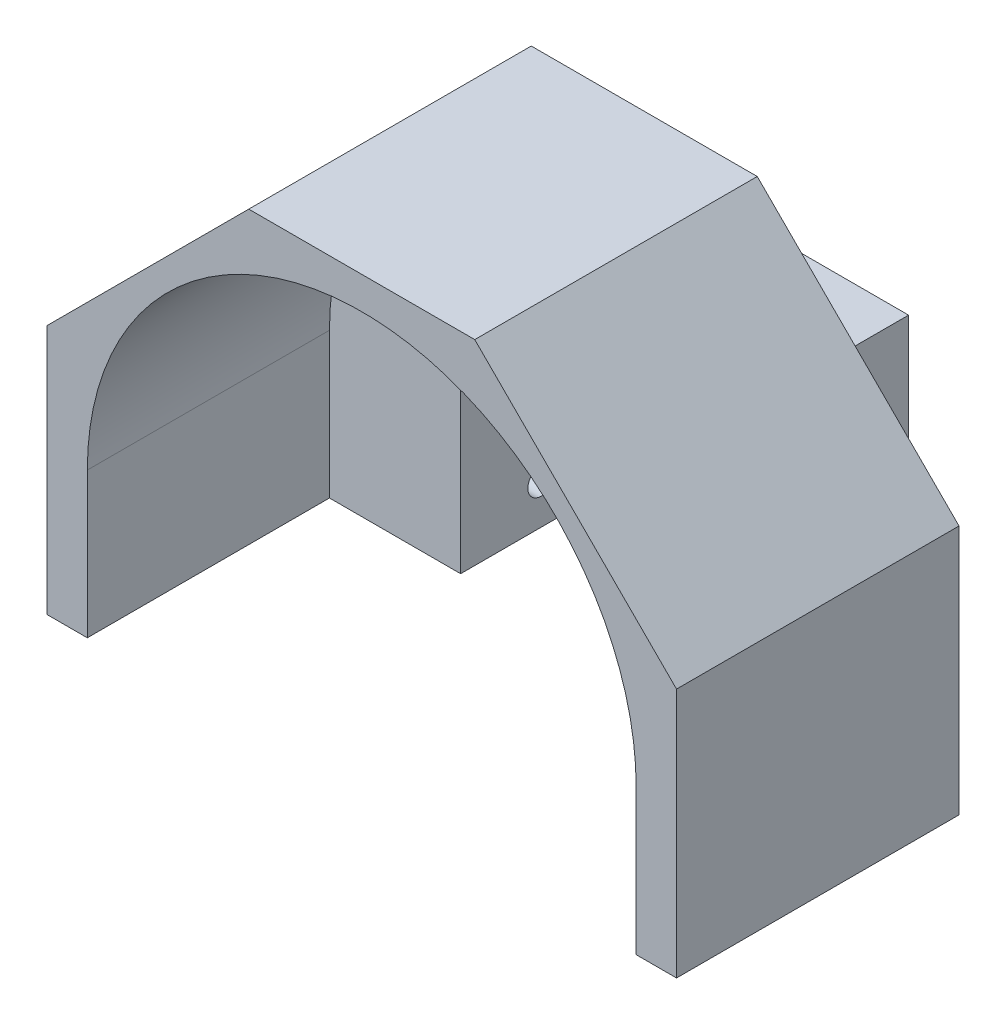
ISO-10303-21;
HEADER;
FILE_DESCRIPTION(('STEP AP214'),'2;1');
FILE_NAME('part.step','',(''),(''),'','','');
FILE_SCHEMA(('AUTOMOTIVE_DESIGN { 1 0 10303 214 1 1 1 1 }'));
ENDSEC;
DATA;
#1=APPLICATION_CONTEXT('core data for automotive mechanical design processes');
#2=APPLICATION_PROTOCOL_DEFINITION('international standard','automotive_design',2000,#1);
#3=PRODUCT_CONTEXT('',#1,'mechanical');
#4=PRODUCT('Part','Part','',(#3));
#5=PRODUCT_RELATED_PRODUCT_CATEGORY('part','',(#4));
#6=PRODUCT_DEFINITION_FORMATION('','',#4);
#7=PRODUCT_DEFINITION_CONTEXT('part definition',#1,'design');
#8=PRODUCT_DEFINITION('design','',#6,#7);
#9=PRODUCT_DEFINITION_SHAPE('','',#8);
#10=(LENGTH_UNIT() NAMED_UNIT(*) SI_UNIT(.MILLI.,.METRE.));
#11=(NAMED_UNIT(*) PLANE_ANGLE_UNIT() SI_UNIT($,.RADIAN.));
#12=(NAMED_UNIT(*) SI_UNIT($,.STERADIAN.) SOLID_ANGLE_UNIT());
#13=UNCERTAINTY_MEASURE_WITH_UNIT(LENGTH_MEASURE(1.E-05),#10,'distance_accuracy_value','');
#14=(GEOMETRIC_REPRESENTATION_CONTEXT(3) GLOBAL_UNCERTAINTY_ASSIGNED_CONTEXT((#13)) GLOBAL_UNIT_ASSIGNED_CONTEXT((#10,
#11,#12)) REPRESENTATION_CONTEXT('',''));
#15=CARTESIAN_POINT('',(0.,0.,0.));
#16=DIRECTION('',(0.,0.,1.));
#17=DIRECTION('',(1.,0.,0.));
#18=AXIS2_PLACEMENT_3D('',#15,#16,#17);
#19=CARTESIAN_POINT('',(39.,28.,45.));
#20=DIRECTION('',(-1.,0.,0.));
#21=DIRECTION('',(0.,0.,1.));
#22=AXIS2_PLACEMENT_3D('',#19,#20,#21);
#23=PLANE('',#22);
#24=DIRECTION('',(0.,0.,1.));
#25=VECTOR('',#24,1.);
#26=CARTESIAN_POINT('',(39.,3.,0.));
#27=LINE('',#26,#25);
#28=CARTESIAN_POINT('',(39.,3.,10.));
#29=VERTEX_POINT('',#28);
#30=CARTESIAN_POINT('',(39.,3.,45.));
#31=VERTEX_POINT('',#30);
#32=EDGE_CURVE('E47',#29,#31,#27,.T.);
#33=ORIENTED_EDGE('',*,*,#32,.T.);
#34=DIRECTION('',(0.,1.,0.));
#35=VECTOR('',#34,1.);
#36=CARTESIAN_POINT('',(39.,28.,45.));
#37=LINE('',#36,#35);
#38=CARTESIAN_POINT('',(39.,-28.,45.));
#39=VERTEX_POINT('',#38);
#40=EDGE_CURVE('E227',#39,#31,#37,.T.);
#41=ORIENTED_EDGE('',*,*,#40,.F.);
#42=DIRECTION('',(0.,0.,-1.));
#43=VECTOR('',#42,1.);
#44=CARTESIAN_POINT('',(39.,-28.,45.));
#45=LINE('',#44,#43);
#46=CARTESIAN_POINT('',(39.,-28.,10.));
#47=VERTEX_POINT('',#46);
#48=EDGE_CURVE('E238',#39,#47,#45,.T.);
#49=ORIENTED_EDGE('',*,*,#48,.T.);
#50=DIRECTION('',(0.,-1.,0.));
#51=VECTOR('',#50,1.);
#52=CARTESIAN_POINT('',(39.,28.,10.));
#53=LINE('',#52,#51);
#54=EDGE_CURVE('E228',#29,#47,#53,.T.);
#55=ORIENTED_EDGE('',*,*,#54,.F.);
#56=EDGE_LOOP('',(#33,#41,#49,#55));
#57=FACE_BOUND('',#56,.T.);
#58=ADVANCED_FACE('F32',(#57),#23,.F.);
#59=CARTESIAN_POINT('',(-39.,28.,45.));
#60=DIRECTION('',(0.,-1.,0.));
#61=DIRECTION('',(0.,0.,-1.));
#62=AXIS2_PLACEMENT_3D('',#59,#60,#61);
#63=PLANE('',#62);
#64=DIRECTION('',(0.,0.,1.));
#65=VECTOR('',#64,1.);
#66=CARTESIAN_POINT('',(14.,28.,0.));
#67=LINE('',#66,#65);
#68=CARTESIAN_POINT('',(14.,28.,10.));
#69=VERTEX_POINT('',#68);
#70=CARTESIAN_POINT('',(14.,28.,45.));
#71=VERTEX_POINT('',#70);
#72=EDGE_CURVE('E218',#69,#71,#67,.T.);
#73=ORIENTED_EDGE('',*,*,#72,.F.);
#74=DIRECTION('',(1.,0.,0.));
#75=VECTOR('',#74,1.);
#76=CARTESIAN_POINT('',(-39.,28.,10.));
#77=LINE('',#76,#75);
#78=CARTESIAN_POINT('',(-14.,28.,10.));
#79=VERTEX_POINT('',#78);
#80=EDGE_CURVE('E304',#79,#69,#77,.T.);
#81=ORIENTED_EDGE('',*,*,#80,.F.);
#82=DIRECTION('',(0.,0.,1.));
#83=VECTOR('',#82,1.);
#84=CARTESIAN_POINT('',(-14.,28.,0.));
#85=LINE('',#84,#83);
#86=CARTESIAN_POINT('',(-14.,28.,45.));
#87=VERTEX_POINT('',#86);
#88=EDGE_CURVE('E54',#79,#87,#85,.T.);
#89=ORIENTED_EDGE('',*,*,#88,.T.);
#90=DIRECTION('',(-1.,0.,0.));
#91=VECTOR('',#90,1.);
#92=CARTESIAN_POINT('',(-39.,28.,45.));
#93=LINE('',#92,#91);
#94=EDGE_CURVE('E235',#71,#87,#93,.T.);
#95=ORIENTED_EDGE('',*,*,#94,.F.);
#96=EDGE_LOOP('',(#73,#81,#89,#95));
#97=FACE_BOUND('',#96,.T.);
#98=ADVANCED_FACE('F438',(#97),#63,.F.);
#99=CARTESIAN_POINT('',(0.,0.,45.));
#100=DIRECTION('',(0.,0.,1.));
#101=DIRECTION('',(1.,0.,0.));
#102=AXIS2_PLACEMENT_3D('',#99,#100,#101);
#103=PLANE('',#102);
#104=ORIENTED_EDGE('',*,*,#40,.T.);
#105=DIRECTION('',(-0.707106781186547,0.707106781186547,0.));
#106=VECTOR('',#105,1.);
#107=CARTESIAN_POINT('',(14.,28.,45.));
#108=LINE('',#107,#106);
#109=EDGE_CURVE('E215',#31,#71,#108,.T.);
#110=ORIENTED_EDGE('',*,*,#109,.T.);
#111=ORIENTED_EDGE('',*,*,#94,.T.);
#112=DIRECTION('',(0.707106781186547,0.707106781186547,0.));
#113=VECTOR('',#112,1.);
#114=CARTESIAN_POINT('',(-14.,28.,45.));
#115=LINE('',#114,#113);
#116=CARTESIAN_POINT('',(-39.,3.,45.));
#117=VERTEX_POINT('',#116);
#118=EDGE_CURVE('E361',#117,#87,#115,.T.);
#119=ORIENTED_EDGE('',*,*,#118,.F.);
#120=DIRECTION('',(0.,-1.,0.));
#121=VECTOR('',#120,1.);
#122=CARTESIAN_POINT('',(-39.,28.,45.));
#123=LINE('',#122,#121);
#124=CARTESIAN_POINT('',(-39.,-28.,45.));
#125=VERTEX_POINT('',#124);
#126=EDGE_CURVE('E246',#117,#125,#123,.T.);
#127=ORIENTED_EDGE('',*,*,#126,.T.);
#128=DIRECTION('',(1.,0.,0.));
#129=VECTOR('',#128,1.);
#130=CARTESIAN_POINT('',(-39.,-28.,45.));
#131=LINE('',#130,#129);
#132=CARTESIAN_POINT('',(-34.,-28.,45.));
#133=VERTEX_POINT('',#132);
#134=EDGE_CURVE('E236',#125,#133,#131,.T.);
#135=ORIENTED_EDGE('',*,*,#134,.T.);
#136=DIRECTION('',(0.,-1.,0.));
#137=VECTOR('',#136,1.);
#138=CARTESIAN_POINT('',(-34.,-28.,45.));
#139=LINE('',#138,#137);
#140=CARTESIAN_POINT('',(-34.,-10.,45.));
#141=VERTEX_POINT('',#140);
#142=EDGE_CURVE('E375',#141,#133,#139,.T.);
#143=ORIENTED_EDGE('',*,*,#142,.F.);
#144=CARTESIAN_POINT('',(0.,-10.,45.));
#145=DIRECTION('',(0.,0.,1.));
#146=DIRECTION('',(1.,0.,0.));
#147=AXIS2_PLACEMENT_3D('',#144,#145,#146);
#148=CIRCLE('',#147,34.);
#149=CARTESIAN_POINT('',(34.,-10.,45.));
#150=VERTEX_POINT('',#149);
#151=EDGE_CURVE('E252',#150,#141,#148,.T.);
#152=ORIENTED_EDGE('',*,*,#151,.F.);
#153=DIRECTION('',(0.,1.,0.));
#154=VECTOR('',#153,1.);
#155=CARTESIAN_POINT('',(34.,-28.,45.));
#156=LINE('',#155,#154);
#157=CARTESIAN_POINT('',(34.,-28.,45.));
#158=VERTEX_POINT('',#157);
#159=EDGE_CURVE('E371',#158,#150,#156,.T.);
#160=ORIENTED_EDGE('',*,*,#159,.F.);
#161=EDGE_CURVE('E233',#158,#39,#131,.T.);
#162=ORIENTED_EDGE('',*,*,#161,.T.);
#163=EDGE_LOOP('',(#104,#110,#111,#119,#127,#135,#143,#152,#160,#162));
#164=FACE_BOUND('',#163,.T.);
#165=ADVANCED_FACE('F230',(#164),#103,.T.);
#166=CARTESIAN_POINT('',(0.,0.,10.));
#167=DIRECTION('',(0.,0.,-1.));
#168=DIRECTION('',(-1.,0.,0.));
#169=AXIS2_PLACEMENT_3D('',#166,#167,#168);
#170=PLANE('',#169);
#171=ORIENTED_EDGE('',*,*,#80,.T.);
#172=DIRECTION('',(0.707106781186548,-0.707106781186548,0.));
#173=VECTOR('',#172,1.);
#174=CARTESIAN_POINT('',(21.,21.,10.));
#175=LINE('',#174,#173);
#176=EDGE_CURVE('E11',#69,#29,#175,.T.);
#177=ORIENTED_EDGE('',*,*,#176,.T.);
#178=ORIENTED_EDGE('',*,*,#54,.T.);
#179=DIRECTION('',(-1.,0.,0.));
#180=VECTOR('',#179,1.);
#181=CARTESIAN_POINT('',(39.,-28.,10.));
#182=LINE('',#181,#180);
#183=CARTESIAN_POINT('',(22.75,-28.,10.));
#184=VERTEX_POINT('',#183);
#185=EDGE_CURVE('E322',#47,#184,#182,.T.);
#186=ORIENTED_EDGE('',*,*,#185,.T.);
#187=DIRECTION('',(0.,1.,0.));
#188=VECTOR('',#187,1.);
#189=CARTESIAN_POINT('',(22.75,-28.,10.));
#190=LINE('',#189,#188);
#191=CARTESIAN_POINT('',(22.75,12.5,10.));
#192=VERTEX_POINT('',#191);
#193=EDGE_CURVE('E381',#184,#192,#190,.T.);
#194=ORIENTED_EDGE('',*,*,#193,.T.);
#195=DIRECTION('',(-1.,0.,0.));
#196=VECTOR('',#195,1.);
#197=CARTESIAN_POINT('',(22.75,12.5,10.));
#198=LINE('',#197,#196);
#199=CARTESIAN_POINT('',(-22.75,12.5,10.));
#200=VERTEX_POINT('',#199);
#201=EDGE_CURVE('E384',#192,#200,#198,.T.);
#202=ORIENTED_EDGE('',*,*,#201,.T.);
#203=DIRECTION('',(0.,-1.,0.));
#204=VECTOR('',#203,1.);
#205=CARTESIAN_POINT('',(-22.75,12.5,10.));
#206=LINE('',#205,#204);
#207=CARTESIAN_POINT('',(-22.75,-28.,10.));
#208=VERTEX_POINT('',#207);
#209=EDGE_CURVE('E307',#200,#208,#206,.T.);
#210=ORIENTED_EDGE('',*,*,#209,.T.);
#211=DIRECTION('',(-1.,0.,0.));
#212=VECTOR('',#211,1.);
#213=CARTESIAN_POINT('',(-22.75,-28.,10.));
#214=LINE('',#213,#212);
#215=CARTESIAN_POINT('',(-39.,-28.,10.));
#216=VERTEX_POINT('',#215);
#217=EDGE_CURVE('E303',#208,#216,#214,.T.);
#218=ORIENTED_EDGE('',*,*,#217,.T.);
#219=DIRECTION('',(0.,1.,0.));
#220=VECTOR('',#219,1.);
#221=CARTESIAN_POINT('',(-39.,-28.,10.));
#222=LINE('',#221,#220);
#223=CARTESIAN_POINT('',(-39.,3.,10.));
#224=VERTEX_POINT('',#223);
#225=EDGE_CURVE('E297',#216,#224,#222,.T.);
#226=ORIENTED_EDGE('',*,*,#225,.T.);
#227=DIRECTION('',(-0.707106781186548,-0.707106781186548,0.));
#228=VECTOR('',#227,1.);
#229=CARTESIAN_POINT('',(-21.,21.,10.));
#230=LINE('',#229,#228);
#231=EDGE_CURVE('E40',#79,#224,#230,.T.);
#232=ORIENTED_EDGE('',*,*,#231,.F.);
#233=EDGE_LOOP('',(#171,#177,#178,#186,#194,#202,#210,#218,#226,#232));
#234=FACE_BOUND('',#233,.T.);
#235=ADVANCED_FACE('F300',(#234),#170,.T.);
#236=CARTESIAN_POINT('',(0.,-10.,15.));
#237=DIRECTION('',(0.,0.,1.));
#238=DIRECTION('',(1.,0.,0.));
#239=AXIS2_PLACEMENT_3D('',#236,#237,#238);
#240=CYLINDRICAL_SURFACE('',#239,34.);
#241=ORIENTED_EDGE('',*,*,#151,.T.);
#242=DIRECTION('',(0.,0.,1.));
#243=VECTOR('',#242,1.);
#244=CARTESIAN_POINT('',(-34.,-10.,-55.3420215802759));
#245=LINE('',#244,#243);
#246=CARTESIAN_POINT('',(-34.,-10.,15.));
#247=VERTEX_POINT('',#246);
#248=EDGE_CURVE('E411',#247,#141,#245,.T.);
#249=ORIENTED_EDGE('',*,*,#248,.F.);
#250=CARTESIAN_POINT('',(0.,-10.,15.));
#251=DIRECTION('',(0.,0.,1.));
#252=DIRECTION('',(1.,0.,0.));
#253=AXIS2_PLACEMENT_3D('',#250,#251,#252);
#254=CIRCLE('',#253,34.);
#255=CARTESIAN_POINT('',(34.,-10.,15.));
#256=VERTEX_POINT('',#255);
#257=EDGE_CURVE('E357',#256,#247,#254,.T.);
#258=ORIENTED_EDGE('',*,*,#257,.F.);
#259=DIRECTION('',(0.,0.,1.));
#260=VECTOR('',#259,1.);
#261=CARTESIAN_POINT('',(34.,-10.,-55.3420215802759));
#262=LINE('',#261,#260);
#263=EDGE_CURVE('E373',#256,#150,#262,.T.);
#264=ORIENTED_EDGE('',*,*,#263,.T.);
#265=EDGE_LOOP('',(#241,#249,#258,#264));
#266=FACE_BOUND('',#265,.T.);
#267=ADVANCED_FACE('F420',(#266),#240,.F.);
#268=CARTESIAN_POINT('',(-39.,28.,45.));
#269=DIRECTION('',(1.,0.,0.));
#270=DIRECTION('',(0.,0.,-1.));
#271=AXIS2_PLACEMENT_3D('',#268,#269,#270);
#272=PLANE('',#271);
#273=ORIENTED_EDGE('',*,*,#126,.F.);
#274=DIRECTION('',(0.,0.,1.));
#275=VECTOR('',#274,1.);
#276=CARTESIAN_POINT('',(-39.,3.,0.));
#277=LINE('',#276,#275);
#278=EDGE_CURVE('E287',#224,#117,#277,.T.);
#279=ORIENTED_EDGE('',*,*,#278,.F.);
#280=ORIENTED_EDGE('',*,*,#225,.F.);
#281=DIRECTION('',(0.,0.,-1.));
#282=VECTOR('',#281,1.);
#283=CARTESIAN_POINT('',(-39.,-28.,45.));
#284=LINE('',#283,#282);
#285=EDGE_CURVE('E249',#125,#216,#284,.T.);
#286=ORIENTED_EDGE('',*,*,#285,.F.);
#287=EDGE_LOOP('',(#273,#279,#280,#286));
#288=FACE_BOUND('',#287,.T.);
#289=ADVANCED_FACE('F34',(#288),#272,.F.);
#290=CARTESIAN_POINT('',(-39.,-28.,45.));
#291=DIRECTION('',(0.,1.,0.));
#292=DIRECTION('',(0.,0.,1.));
#293=AXIS2_PLACEMENT_3D('',#290,#291,#292);
#294=PLANE('',#293);
#295=DIRECTION('',(1.,0.,0.));
#296=VECTOR('',#295,1.);
#297=CARTESIAN_POINT('',(-39.,-28.,15.));
#298=LINE('',#297,#296);
#299=CARTESIAN_POINT('',(-34.,-28.,15.));
#300=VERTEX_POINT('',#299);
#301=CARTESIAN_POINT('',(-17.75,-28.,15.));
#302=VERTEX_POINT('',#301);
#303=EDGE_CURVE('E256',#300,#302,#298,.T.);
#304=ORIENTED_EDGE('',*,*,#303,.F.);
#305=DIRECTION('',(0.,0.,1.));
#306=VECTOR('',#305,1.);
#307=CARTESIAN_POINT('',(-34.,-28.,-55.3420215802759));
#308=LINE('',#307,#306);
#309=EDGE_CURVE('E366',#300,#133,#308,.T.);
#310=ORIENTED_EDGE('',*,*,#309,.T.);
#311=ORIENTED_EDGE('',*,*,#134,.F.);
#312=ORIENTED_EDGE('',*,*,#285,.T.);
#313=ORIENTED_EDGE('',*,*,#217,.F.);
#314=DIRECTION('',(0.,0.,-1.));
#315=VECTOR('',#314,1.);
#316=CARTESIAN_POINT('',(-22.75,-28.,10.));
#317=LINE('',#316,#315);
#318=CARTESIAN_POINT('',(-22.75,-28.,0.));
#319=VERTEX_POINT('',#318);
#320=EDGE_CURVE('E323',#208,#319,#317,.T.);
#321=ORIENTED_EDGE('',*,*,#320,.T.);
#322=DIRECTION('',(1.,0.,0.));
#323=VECTOR('',#322,1.);
#324=CARTESIAN_POINT('',(-39.,-28.,0.));
#325=LINE('',#324,#323);
#326=CARTESIAN_POINT('',(-17.75,-28.,0.));
#327=VERTEX_POINT('',#326);
#328=EDGE_CURVE('E244',#319,#327,#325,.T.);
#329=ORIENTED_EDGE('',*,*,#328,.T.);
#330=DIRECTION('',(0.,0.,-1.));
#331=VECTOR('',#330,1.);
#332=CARTESIAN_POINT('',(-17.75,-28.,65.2045814642449));
#333=LINE('',#332,#331);
#334=EDGE_CURVE('E335',#302,#327,#333,.T.);
#335=ORIENTED_EDGE('',*,*,#334,.F.);
#336=EDGE_LOOP('',(#304,#310,#311,#312,#313,#321,#329,#335));
#337=FACE_BOUND('',#336,.T.);
#338=ADVANCED_FACE('F364',(#337),#294,.F.);
#339=ORIENTED_EDGE('',*,*,#161,.F.);
#340=DIRECTION('',(0.,0.,1.));
#341=VECTOR('',#340,1.);
#342=CARTESIAN_POINT('',(34.,-28.,-55.3420215802759));
#343=LINE('',#342,#341);
#344=CARTESIAN_POINT('',(34.,-28.,15.));
#345=VERTEX_POINT('',#344);
#346=EDGE_CURVE('E370',#345,#158,#343,.T.);
#347=ORIENTED_EDGE('',*,*,#346,.F.);
#348=CARTESIAN_POINT('',(17.75,-28.,15.));
#349=VERTEX_POINT('',#348);
#350=EDGE_CURVE('E255',#349,#345,#298,.T.);
#351=ORIENTED_EDGE('',*,*,#350,.F.);
#352=DIRECTION('',(0.,0.,-1.));
#353=VECTOR('',#352,1.);
#354=CARTESIAN_POINT('',(17.75,-28.,65.2045814642449));
#355=LINE('',#354,#353);
#356=CARTESIAN_POINT('',(17.75,-28.,0.));
#357=VERTEX_POINT('',#356);
#358=EDGE_CURVE('E342',#349,#357,#355,.T.);
#359=ORIENTED_EDGE('',*,*,#358,.T.);
#360=CARTESIAN_POINT('',(22.75,-28.,0.));
#361=VERTEX_POINT('',#360);
#362=EDGE_CURVE('E247',#357,#361,#325,.T.);
#363=ORIENTED_EDGE('',*,*,#362,.T.);
#364=DIRECTION('',(0.,0.,-1.));
#365=VECTOR('',#364,1.);
#366=CARTESIAN_POINT('',(22.75,-28.,10.));
#367=LINE('',#366,#365);
#368=EDGE_CURVE('E312',#184,#361,#367,.T.);
#369=ORIENTED_EDGE('',*,*,#368,.F.);
#370=ORIENTED_EDGE('',*,*,#185,.F.);
#371=ORIENTED_EDGE('',*,*,#48,.F.);
#372=EDGE_LOOP('',(#339,#347,#351,#359,#363,#369,#370,#371));
#373=FACE_BOUND('',#372,.T.);
#374=ADVANCED_FACE('F446',(#373),#294,.F.);
#375=CARTESIAN_POINT('',(0.,0.,0.));
#376=DIRECTION('',(0.,0.,1.));
#377=DIRECTION('',(1.,0.,0.));
#378=AXIS2_PLACEMENT_3D('',#375,#376,#377);
#379=PLANE('',#378);
#380=ORIENTED_EDGE('',*,*,#328,.F.);
#381=DIRECTION('',(0.,-1.,0.));
#382=VECTOR('',#381,1.);
#383=CARTESIAN_POINT('',(-22.75,12.5,0.));
#384=LINE('',#383,#382);
#385=CARTESIAN_POINT('',(-22.75,12.5,0.));
#386=VERTEX_POINT('',#385);
#387=EDGE_CURVE('E320',#386,#319,#384,.T.);
#388=ORIENTED_EDGE('',*,*,#387,.F.);
#389=DIRECTION('',(-1.,0.,0.));
#390=VECTOR('',#389,1.);
#391=CARTESIAN_POINT('',(22.75,12.5,0.));
#392=LINE('',#391,#390);
#393=CARTESIAN_POINT('',(22.75,12.5,0.));
#394=VERTEX_POINT('',#393);
#395=EDGE_CURVE('E316',#394,#386,#392,.T.);
#396=ORIENTED_EDGE('',*,*,#395,.F.);
#397=DIRECTION('',(0.,1.,0.));
#398=VECTOR('',#397,1.);
#399=CARTESIAN_POINT('',(22.75,-28.,0.));
#400=LINE('',#399,#398);
#401=EDGE_CURVE('E313',#361,#394,#400,.T.);
#402=ORIENTED_EDGE('',*,*,#401,.F.);
#403=ORIENTED_EDGE('',*,*,#362,.F.);
#404=DIRECTION('',(0.,-1.,0.));
#405=VECTOR('',#404,1.);
#406=CARTESIAN_POINT('',(17.75,7.5,0.));
#407=LINE('',#406,#405);
#408=CARTESIAN_POINT('',(17.75,7.5,0.));
#409=VERTEX_POINT('',#408);
#410=EDGE_CURVE('E326',#409,#357,#407,.T.);
#411=ORIENTED_EDGE('',*,*,#410,.F.);
#412=DIRECTION('',(1.,0.,0.));
#413=VECTOR('',#412,1.);
#414=CARTESIAN_POINT('',(17.75,7.5,0.));
#415=LINE('',#414,#413);
#416=CARTESIAN_POINT('',(-17.75,7.50000000000001,0.));
#417=VERTEX_POINT('',#416);
#418=EDGE_CURVE('E332',#417,#409,#415,.T.);
#419=ORIENTED_EDGE('',*,*,#418,.F.);
#420=DIRECTION('',(0.,1.,0.));
#421=VECTOR('',#420,1.);
#422=CARTESIAN_POINT('',(-17.75,7.50000000000001,0.));
#423=LINE('',#422,#421);
#424=EDGE_CURVE('E336',#327,#417,#423,.T.);
#425=ORIENTED_EDGE('',*,*,#424,.F.);
#426=EDGE_LOOP('',(#380,#388,#396,#402,#403,#411,#419,#425));
#427=FACE_BOUND('',#426,.T.);
#428=ADVANCED_FACE('F393',(#427),#379,.F.);
#429=CARTESIAN_POINT('',(0.,-10.,15.));
#430=DIRECTION('',(0.,0.,1.));
#431=DIRECTION('',(1.,0.,0.));
#432=AXIS2_PLACEMENT_3D('',#429,#430,#431);
#433=PLANE('',#432);
#434=DIRECTION('',(0.,-1.,0.));
#435=VECTOR('',#434,1.);
#436=CARTESIAN_POINT('',(13.75,11.5,15.));
#437=LINE('',#436,#435);
#438=CARTESIAN_POINT('',(13.75,11.5,15.));
#439=VERTEX_POINT('',#438);
#440=CARTESIAN_POINT('',(13.75,7.5,15.));
#441=VERTEX_POINT('',#440);
#442=EDGE_CURVE('E298',#439,#441,#437,.T.);
#443=ORIENTED_EDGE('',*,*,#442,.F.);
#444=DIRECTION('',(-1.,0.,0.));
#445=VECTOR('',#444,1.);
#446=CARTESIAN_POINT('',(13.75,11.5,15.));
#447=LINE('',#446,#445);
#448=CARTESIAN_POINT('',(21.75,11.5,15.));
#449=VERTEX_POINT('',#448);
#450=EDGE_CURVE('E466',#449,#439,#447,.T.);
#451=ORIENTED_EDGE('',*,*,#450,.F.);
#452=DIRECTION('',(0.,1.,0.));
#453=VECTOR('',#452,1.);
#454=CARTESIAN_POINT('',(21.75,11.5,15.));
#455=LINE('',#454,#453);
#456=CARTESIAN_POINT('',(21.75,3.5,15.));
#457=VERTEX_POINT('',#456);
#458=EDGE_CURVE('E478',#457,#449,#455,.T.);
#459=ORIENTED_EDGE('',*,*,#458,.F.);
#460=DIRECTION('',(1.,0.,0.));
#461=VECTOR('',#460,1.);
#462=CARTESIAN_POINT('',(13.75,3.5,15.));
#463=LINE('',#462,#461);
#464=CARTESIAN_POINT('',(17.75,3.5,15.));
#465=VERTEX_POINT('',#464);
#466=EDGE_CURVE('E476',#465,#457,#463,.T.);
#467=ORIENTED_EDGE('',*,*,#466,.F.);
#468=DIRECTION('',(0.,-1.,0.));
#469=VECTOR('',#468,1.);
#470=CARTESIAN_POINT('',(17.75,7.5,15.));
#471=LINE('',#470,#469);
#472=EDGE_CURVE('E340',#465,#349,#471,.T.);
#473=ORIENTED_EDGE('',*,*,#472,.T.);
#474=ORIENTED_EDGE('',*,*,#350,.T.);
#475=DIRECTION('',(0.,-1.,0.));
#476=VECTOR('',#475,1.);
#477=CARTESIAN_POINT('',(34.,-28.,15.));
#478=LINE('',#477,#476);
#479=EDGE_CURVE('E408',#256,#345,#478,.T.);
#480=ORIENTED_EDGE('',*,*,#479,.F.);
#481=ORIENTED_EDGE('',*,*,#257,.T.);
#482=DIRECTION('',(0.,1.,0.));
#483=VECTOR('',#482,1.);
#484=CARTESIAN_POINT('',(-34.,-28.,15.));
#485=LINE('',#484,#483);
#486=EDGE_CURVE('E317',#300,#247,#485,.T.);
#487=ORIENTED_EDGE('',*,*,#486,.F.);
#488=ORIENTED_EDGE('',*,*,#303,.T.);
#489=DIRECTION('',(0.,1.,0.));
#490=VECTOR('',#489,1.);
#491=CARTESIAN_POINT('',(-17.75,7.50000000000001,15.));
#492=LINE('',#491,#490);
#493=CARTESIAN_POINT('',(-17.75,3.5,15.));
#494=VERTEX_POINT('',#493);
#495=EDGE_CURVE('E348',#302,#494,#492,.T.);
#496=ORIENTED_EDGE('',*,*,#495,.T.);
#497=DIRECTION('',(1.,0.,0.));
#498=VECTOR('',#497,1.);
#499=CARTESIAN_POINT('',(-21.75,3.5,15.));
#500=LINE('',#499,#498);
#501=CARTESIAN_POINT('',(-21.75,3.5,15.));
#502=VERTEX_POINT('',#501);
#503=EDGE_CURVE('E519',#502,#494,#500,.T.);
#504=ORIENTED_EDGE('',*,*,#503,.F.);
#505=DIRECTION('',(0.,-1.,0.));
#506=VECTOR('',#505,1.);
#507=CARTESIAN_POINT('',(-21.75,3.5,15.));
#508=LINE('',#507,#506);
#509=CARTESIAN_POINT('',(-21.75,11.5,15.));
#510=VERTEX_POINT('',#509);
#511=EDGE_CURVE('E503',#510,#502,#508,.T.);
#512=ORIENTED_EDGE('',*,*,#511,.F.);
#513=DIRECTION('',(-1.,0.,0.));
#514=VECTOR('',#513,1.);
#515=CARTESIAN_POINT('',(-21.75,11.5,15.));
#516=LINE('',#515,#514);
#517=CARTESIAN_POINT('',(-13.75,11.5,15.));
#518=VERTEX_POINT('',#517);
#519=EDGE_CURVE('E508',#518,#510,#516,.T.);
#520=ORIENTED_EDGE('',*,*,#519,.F.);
#521=DIRECTION('',(0.,1.,0.));
#522=VECTOR('',#521,1.);
#523=CARTESIAN_POINT('',(-13.75,3.5,15.));
#524=LINE('',#523,#522);
#525=CARTESIAN_POINT('',(-13.75,7.50000000000001,15.));
#526=VERTEX_POINT('',#525);
#527=EDGE_CURVE('E521',#526,#518,#524,.T.);
#528=ORIENTED_EDGE('',*,*,#527,.F.);
#529=DIRECTION('',(1.,0.,0.));
#530=VECTOR('',#529,1.);
#531=CARTESIAN_POINT('',(17.75,7.5,15.));
#532=LINE('',#531,#530);
#533=EDGE_CURVE('E344',#526,#441,#532,.T.);
#534=ORIENTED_EDGE('',*,*,#533,.T.);
#535=EDGE_LOOP('',(#443,#451,#459,#467,#473,#474,#480,#481,#487,#488,#496,#504,#512,#520,#528,#534));
#536=FACE_BOUND('',#535,.T.);
#537=ADVANCED_FACE('F403',(#536),#433,.T.);
#538=CARTESIAN_POINT('',(-17.75,7.50000000000001,65.2045814642449));
#539=DIRECTION('',(-1.,0.,0.));
#540=DIRECTION('',(0.,-1.,0.));
#541=AXIS2_PLACEMENT_3D('',#538,#539,#540);
#542=PLANE('',#541);
#543=CARTESIAN_POINT('',(-17.75,2.5,5.));
#544=DIRECTION('',(-1.,0.,0.));
#545=DIRECTION('',(0.,-1.,0.));
#546=AXIS2_PLACEMENT_3D('',#543,#544,#545);
#547=CIRCLE('',#546,1.5);
#548=CARTESIAN_POINT('',(-17.75,1.,5.));
#549=VERTEX_POINT('',#548);
#550=EDGE_CURVE('E537',#549,#549,#547,.T.);
#551=ORIENTED_EDGE('',*,*,#550,.T.);
#552=EDGE_LOOP('',(#551));
#553=FACE_BOUND('',#552,.T.);
#554=CARTESIAN_POINT('',(-17.75,-23.,5.));
#555=DIRECTION('',(-1.,0.,0.));
#556=DIRECTION('',(0.,-1.,0.));
#557=AXIS2_PLACEMENT_3D('',#554,#555,#556);
#558=CIRCLE('',#557,1.67146663937658);
#559=CARTESIAN_POINT('',(-17.75,-24.6714666393766,5.));
#560=VERTEX_POINT('',#559);
#561=EDGE_CURVE('E415',#560,#560,#558,.T.);
#562=ORIENTED_EDGE('',*,*,#561,.T.);
#563=EDGE_LOOP('',(#562));
#564=FACE_BOUND('',#563,.T.);
#565=DIRECTION('',(0.,-1.,0.));
#566=VECTOR('',#565,1.);
#567=CARTESIAN_POINT('',(-17.75,7.50000000000001,11.));
#568=LINE('',#567,#566);
#569=CARTESIAN_POINT('',(-17.75,7.50000000000001,11.));
#570=VERTEX_POINT('',#569);
#571=CARTESIAN_POINT('',(-17.75,3.5,11.));
#572=VERTEX_POINT('',#571);
#573=EDGE_CURVE('E527',#570,#572,#568,.T.);
#574=ORIENTED_EDGE('',*,*,#573,.T.);
#575=DIRECTION('',(0.,0.,1.));
#576=VECTOR('',#575,1.);
#577=CARTESIAN_POINT('',(-17.75,3.5,65.2045814642449));
#578=LINE('',#577,#576);
#579=EDGE_CURVE('E275',#572,#494,#578,.T.);
#580=ORIENTED_EDGE('',*,*,#579,.T.);
#581=ORIENTED_EDGE('',*,*,#495,.F.);
#582=ORIENTED_EDGE('',*,*,#334,.T.);
#583=ORIENTED_EDGE('',*,*,#424,.T.);
#584=DIRECTION('',(0.,0.,-1.));
#585=VECTOR('',#584,1.);
#586=CARTESIAN_POINT('',(-17.75,7.50000000000001,65.2045814642449));
#587=LINE('',#586,#585);
#588=EDGE_CURVE('E347',#570,#417,#587,.T.);
#589=ORIENTED_EDGE('',*,*,#588,.F.);
#590=EDGE_LOOP('',(#574,#580,#581,#582,#583,#589));
#591=FACE_BOUND('',#590,.T.);
#592=ADVANCED_FACE('F400',(#553,#564,#591),#542,.F.);
#593=CARTESIAN_POINT('',(17.75,7.5,65.2045814642449));
#594=DIRECTION('',(0.,1.,0.));
#595=DIRECTION('',(-1.,0.,0.));
#596=AXIS2_PLACEMENT_3D('',#593,#594,#595);
#597=PLANE('',#596);
#598=CARTESIAN_POINT('',(12.75,7.5,5.));
#599=DIRECTION('',(0.,1.,0.));
#600=DIRECTION('',(-1.,0.,0.));
#601=AXIS2_PLACEMENT_3D('',#598,#599,#600);
#602=CIRCLE('',#601,1.5);
#603=CARTESIAN_POINT('',(11.25,7.5,5.));
#604=VERTEX_POINT('',#603);
#605=EDGE_CURVE('E494',#604,#604,#602,.T.);
#606=ORIENTED_EDGE('',*,*,#605,.T.);
#607=EDGE_LOOP('',(#606));
#608=FACE_BOUND('',#607,.T.);
#609=CARTESIAN_POINT('',(-12.75,7.50000000000001,5.));
#610=DIRECTION('',(0.,1.,0.));
#611=DIRECTION('',(-1.,0.,0.));
#612=AXIS2_PLACEMENT_3D('',#609,#610,#611);
#613=CIRCLE('',#612,1.5);
#614=CARTESIAN_POINT('',(-14.25,7.50000000000001,5.));
#615=VERTEX_POINT('',#614);
#616=EDGE_CURVE('E500',#615,#615,#613,.T.);
#617=ORIENTED_EDGE('',*,*,#616,.T.);
#618=EDGE_LOOP('',(#617));
#619=FACE_BOUND('',#618,.T.);
#620=DIRECTION('',(1.,0.,0.));
#621=VECTOR('',#620,1.);
#622=CARTESIAN_POINT('',(17.75,7.5,11.));
#623=LINE('',#622,#621);
#624=CARTESIAN_POINT('',(13.75,7.5,11.));
#625=VERTEX_POINT('',#624);
#626=CARTESIAN_POINT('',(17.75,7.5,11.));
#627=VERTEX_POINT('',#626);
#628=EDGE_CURVE('E485',#625,#627,#623,.T.);
#629=ORIENTED_EDGE('',*,*,#628,.F.);
#630=DIRECTION('',(0.,0.,1.));
#631=VECTOR('',#630,1.);
#632=CARTESIAN_POINT('',(13.75,7.5,65.2045814642449));
#633=LINE('',#632,#631);
#634=EDGE_CURVE('E283',#625,#441,#633,.T.);
#635=ORIENTED_EDGE('',*,*,#634,.T.);
#636=ORIENTED_EDGE('',*,*,#533,.F.);
#637=DIRECTION('',(0.,0.,-1.));
#638=VECTOR('',#637,1.);
#639=CARTESIAN_POINT('',(-13.75,7.5,65.2045814642449));
#640=LINE('',#639,#638);
#641=CARTESIAN_POINT('',(-13.75,7.50000000000001,11.));
#642=VERTEX_POINT('',#641);
#643=EDGE_CURVE('E272',#526,#642,#640,.T.);
#644=ORIENTED_EDGE('',*,*,#643,.T.);
#645=DIRECTION('',(-1.,0.,0.));
#646=VECTOR('',#645,1.);
#647=CARTESIAN_POINT('',(17.75,7.5,11.));
#648=LINE('',#647,#646);
#649=EDGE_CURVE('E259',#642,#570,#648,.T.);
#650=ORIENTED_EDGE('',*,*,#649,.T.);
#651=ORIENTED_EDGE('',*,*,#588,.T.);
#652=ORIENTED_EDGE('',*,*,#418,.T.);
#653=DIRECTION('',(0.,0.,-1.));
#654=VECTOR('',#653,1.);
#655=CARTESIAN_POINT('',(17.75,7.5,65.2045814642449));
#656=LINE('',#655,#654);
#657=EDGE_CURVE('E343',#627,#409,#656,.T.);
#658=ORIENTED_EDGE('',*,*,#657,.F.);
#659=EDGE_LOOP('',(#629,#635,#636,#644,#650,#651,#652,#658));
#660=FACE_BOUND('',#659,.T.);
#661=ADVANCED_FACE('F764',(#608,#619,#660),#597,.F.);
#662=CARTESIAN_POINT('',(17.75,7.5,65.2045814642449));
#663=DIRECTION('',(1.,0.,0.));
#664=DIRECTION('',(0.,1.,0.));
#665=AXIS2_PLACEMENT_3D('',#662,#663,#664);
#666=PLANE('',#665);
#667=CARTESIAN_POINT('',(17.75,2.5,5.));
#668=DIRECTION('',(1.,0.,0.));
#669=DIRECTION('',(0.,1.,0.));
#670=AXIS2_PLACEMENT_3D('',#667,#668,#669);
#671=CIRCLE('',#670,1.5);
#672=CARTESIAN_POINT('',(17.75,4.,5.));
#673=VERTEX_POINT('',#672);
#674=EDGE_CURVE('E268',#673,#673,#671,.T.);
#675=ORIENTED_EDGE('',*,*,#674,.T.);
#676=EDGE_LOOP('',(#675));
#677=FACE_BOUND('',#676,.T.);
#678=CARTESIAN_POINT('',(17.75,-23.,5.));
#679=DIRECTION('',(1.,0.,0.));
#680=DIRECTION('',(0.,1.,0.));
#681=AXIS2_PLACEMENT_3D('',#678,#679,#680);
#682=CIRCLE('',#681,1.67146663937658);
#683=CARTESIAN_POINT('',(17.75,-21.3285333606234,5.));
#684=VERTEX_POINT('',#683);
#685=EDGE_CURVE('E263',#684,#684,#682,.T.);
#686=ORIENTED_EDGE('',*,*,#685,.T.);
#687=EDGE_LOOP('',(#686));
#688=FACE_BOUND('',#687,.T.);
#689=ORIENTED_EDGE('',*,*,#472,.F.);
#690=DIRECTION('',(0.,0.,-1.));
#691=VECTOR('',#690,1.);
#692=CARTESIAN_POINT('',(17.75,3.5,65.2045814642449));
#693=LINE('',#692,#691);
#694=CARTESIAN_POINT('',(17.75,3.5,11.));
#695=VERTEX_POINT('',#694);
#696=EDGE_CURVE('E280',#465,#695,#693,.T.);
#697=ORIENTED_EDGE('',*,*,#696,.T.);
#698=DIRECTION('',(0.,-1.,0.));
#699=VECTOR('',#698,1.);
#700=CARTESIAN_POINT('',(17.75,7.5,11.));
#701=LINE('',#700,#699);
#702=EDGE_CURVE('E278',#627,#695,#701,.T.);
#703=ORIENTED_EDGE('',*,*,#702,.F.);
#704=ORIENTED_EDGE('',*,*,#657,.T.);
#705=ORIENTED_EDGE('',*,*,#410,.T.);
#706=ORIENTED_EDGE('',*,*,#358,.F.);
#707=EDGE_LOOP('',(#689,#697,#703,#704,#705,#706));
#708=FACE_BOUND('',#707,.T.);
#709=ADVANCED_FACE('F701',(#677,#688,#708),#666,.F.);
#710=CARTESIAN_POINT('',(-22.75,12.5,10.));
#711=DIRECTION('',(1.,0.,0.));
#712=DIRECTION('',(0.,1.,0.));
#713=AXIS2_PLACEMENT_3D('',#710,#711,#712);
#714=PLANE('',#713);
#715=CARTESIAN_POINT('',(-22.75,2.5,5.));
#716=DIRECTION('',(-1.,0.,0.));
#717=DIRECTION('',(0.,-1.,0.));
#718=AXIS2_PLACEMENT_3D('',#715,#716,#717);
#719=CIRCLE('',#718,1.5);
#720=CARTESIAN_POINT('',(-22.75,1.,5.));
#721=VERTEX_POINT('',#720);
#722=EDGE_CURVE('E269',#721,#721,#719,.T.);
#723=ORIENTED_EDGE('',*,*,#722,.F.);
#724=EDGE_LOOP('',(#723));
#725=FACE_BOUND('',#724,.T.);
#726=CARTESIAN_POINT('',(-22.75,-23.,5.));
#727=DIRECTION('',(-1.,0.,0.));
#728=DIRECTION('',(0.,-1.,0.));
#729=AXIS2_PLACEMENT_3D('',#726,#727,#728);
#730=CIRCLE('',#729,1.67146663937658);
#731=CARTESIAN_POINT('',(-22.75,-24.6714666393766,5.));
#732=VERTEX_POINT('',#731);
#733=EDGE_CURVE('E264',#732,#732,#730,.T.);
#734=ORIENTED_EDGE('',*,*,#733,.F.);
#735=EDGE_LOOP('',(#734));
#736=FACE_BOUND('',#735,.T.);
#737=ORIENTED_EDGE('',*,*,#387,.T.);
#738=ORIENTED_EDGE('',*,*,#320,.F.);
#739=ORIENTED_EDGE('',*,*,#209,.F.);
#740=DIRECTION('',(0.,0.,-1.));
#741=VECTOR('',#740,1.);
#742=CARTESIAN_POINT('',(-22.75,12.5,10.));
#743=LINE('',#742,#741);
#744=EDGE_CURVE('E327',#200,#386,#743,.T.);
#745=ORIENTED_EDGE('',*,*,#744,.T.);
#746=EDGE_LOOP('',(#737,#738,#739,#745));
#747=FACE_BOUND('',#746,.T.);
#748=ADVANCED_FACE('F697',(#725,#736,#747),#714,.F.);
#749=CARTESIAN_POINT('',(22.75,12.5,10.));
#750=DIRECTION('',(0.,-1.,0.));
#751=DIRECTION('',(0.,0.,-1.));
#752=AXIS2_PLACEMENT_3D('',#749,#750,#751);
#753=PLANE('',#752);
#754=CARTESIAN_POINT('',(12.75,12.5,5.));
#755=DIRECTION('',(0.,1.,0.));
#756=DIRECTION('',(0.,0.,1.));
#757=AXIS2_PLACEMENT_3D('',#754,#755,#756);
#758=CIRCLE('',#757,1.5);
#759=CARTESIAN_POINT('',(12.75,12.5,6.5));
#760=VERTEX_POINT('',#759);
#761=EDGE_CURVE('E491',#760,#760,#758,.T.);
#762=ORIENTED_EDGE('',*,*,#761,.F.);
#763=EDGE_LOOP('',(#762));
#764=FACE_BOUND('',#763,.T.);
#765=CARTESIAN_POINT('',(-12.75,12.5,5.));
#766=DIRECTION('',(0.,1.,0.));
#767=DIRECTION('',(0.,0.,1.));
#768=AXIS2_PLACEMENT_3D('',#765,#766,#767);
#769=CIRCLE('',#768,1.5);
#770=CARTESIAN_POINT('',(-12.75,12.5,6.5));
#771=VERTEX_POINT('',#770);
#772=EDGE_CURVE('E497',#771,#771,#769,.T.);
#773=ORIENTED_EDGE('',*,*,#772,.F.);
#774=EDGE_LOOP('',(#773));
#775=FACE_BOUND('',#774,.T.);
#776=ORIENTED_EDGE('',*,*,#395,.T.);
#777=ORIENTED_EDGE('',*,*,#744,.F.);
#778=ORIENTED_EDGE('',*,*,#201,.F.);
#779=DIRECTION('',(0.,0.,-1.));
#780=VECTOR('',#779,1.);
#781=CARTESIAN_POINT('',(22.75,12.5,10.));
#782=LINE('',#781,#780);
#783=EDGE_CURVE('E329',#192,#394,#782,.T.);
#784=ORIENTED_EDGE('',*,*,#783,.T.);
#785=EDGE_LOOP('',(#776,#777,#778,#784));
#786=FACE_BOUND('',#785,.T.);
#787=ADVANCED_FACE('F433',(#764,#775,#786),#753,.F.);
#788=CARTESIAN_POINT('',(22.75,-28.,10.));
#789=DIRECTION('',(-1.,0.,0.));
#790=DIRECTION('',(0.,0.,1.));
#791=AXIS2_PLACEMENT_3D('',#788,#789,#790);
#792=PLANE('',#791);
#793=CARTESIAN_POINT('',(22.75,2.5,5.));
#794=DIRECTION('',(-1.,0.,0.));
#795=DIRECTION('',(0.,0.,1.));
#796=AXIS2_PLACEMENT_3D('',#793,#794,#795);
#797=CIRCLE('',#796,1.5);
#798=CARTESIAN_POINT('',(22.75,2.5,6.5));
#799=VERTEX_POINT('',#798);
#800=EDGE_CURVE('E265',#799,#799,#797,.T.);
#801=ORIENTED_EDGE('',*,*,#800,.T.);
#802=EDGE_LOOP('',(#801));
#803=FACE_BOUND('',#802,.T.);
#804=CARTESIAN_POINT('',(22.75,-23.,5.));
#805=DIRECTION('',(-1.,0.,0.));
#806=DIRECTION('',(0.,0.,1.));
#807=AXIS2_PLACEMENT_3D('',#804,#805,#806);
#808=CIRCLE('',#807,1.67146663937658);
#809=CARTESIAN_POINT('',(22.75,-23.,6.67146663937658));
#810=VERTEX_POINT('',#809);
#811=EDGE_CURVE('E260',#810,#810,#808,.T.);
#812=ORIENTED_EDGE('',*,*,#811,.T.);
#813=EDGE_LOOP('',(#812));
#814=FACE_BOUND('',#813,.T.);
#815=ORIENTED_EDGE('',*,*,#401,.T.);
#816=ORIENTED_EDGE('',*,*,#783,.F.);
#817=ORIENTED_EDGE('',*,*,#193,.F.);
#818=ORIENTED_EDGE('',*,*,#368,.T.);
#819=EDGE_LOOP('',(#815,#816,#817,#818));
#820=FACE_BOUND('',#819,.T.);
#821=ADVANCED_FACE('F425',(#803,#814,#820),#792,.F.);
#822=CARTESIAN_POINT('',(-34.,-28.,-55.3420215802759));
#823=DIRECTION('',(-1.,0.,0.));
#824=DIRECTION('',(0.,0.,1.));
#825=AXIS2_PLACEMENT_3D('',#822,#823,#824);
#826=PLANE('',#825);
#827=ORIENTED_EDGE('',*,*,#486,.T.);
#828=ORIENTED_EDGE('',*,*,#248,.T.);
#829=ORIENTED_EDGE('',*,*,#142,.T.);
#830=ORIENTED_EDGE('',*,*,#309,.F.);
#831=EDGE_LOOP('',(#827,#828,#829,#830));
#832=FACE_BOUND('',#831,.T.);
#833=ADVANCED_FACE('F422',(#832),#826,.F.);
#834=CARTESIAN_POINT('',(34.,-28.,-55.3420215802759));
#835=DIRECTION('',(1.,0.,0.));
#836=DIRECTION('',(0.,0.,-1.));
#837=AXIS2_PLACEMENT_3D('',#834,#835,#836);
#838=PLANE('',#837);
#839=ORIENTED_EDGE('',*,*,#479,.T.);
#840=ORIENTED_EDGE('',*,*,#346,.T.);
#841=ORIENTED_EDGE('',*,*,#159,.T.);
#842=ORIENTED_EDGE('',*,*,#263,.F.);
#843=EDGE_LOOP('',(#839,#840,#841,#842));
#844=FACE_BOUND('',#843,.T.);
#845=ADVANCED_FACE('F424',(#844),#838,.F.);
#846=CARTESIAN_POINT('',(39.,-23.,5.));
#847=DIRECTION('',(-1.,0.,0.));
#848=DIRECTION('',(0.,-1.,0.));
#849=AXIS2_PLACEMENT_3D('',#846,#847,#848);
#850=CYLINDRICAL_SURFACE('',#849,1.67146663937658);
#851=ORIENTED_EDGE('',*,*,#811,.F.);
#852=EDGE_LOOP('',(#851));
#853=FACE_BOUND('',#852,.T.);
#854=ORIENTED_EDGE('',*,*,#685,.F.);
#855=EDGE_LOOP('',(#854));
#856=FACE_BOUND('',#855,.T.);
#857=ADVANCED_FACE('F431',(#853,#856),#850,.F.);
#858=ORIENTED_EDGE('',*,*,#733,.T.);
#859=EDGE_LOOP('',(#858));
#860=FACE_BOUND('',#859,.T.);
#861=ORIENTED_EDGE('',*,*,#561,.F.);
#862=EDGE_LOOP('',(#861));
#863=FACE_BOUND('',#862,.T.);
#864=ADVANCED_FACE('F547',(#860,#863),#850,.F.);
#865=CARTESIAN_POINT('',(39.,2.49999999999999,5.));
#866=DIRECTION('',(-1.,0.,0.));
#867=DIRECTION('',(0.,-1.,0.));
#868=AXIS2_PLACEMENT_3D('',#865,#866,#867);
#869=CYLINDRICAL_SURFACE('',#868,1.5);
#870=ORIENTED_EDGE('',*,*,#800,.F.);
#871=EDGE_LOOP('',(#870));
#872=FACE_BOUND('',#871,.T.);
#873=ORIENTED_EDGE('',*,*,#674,.F.);
#874=EDGE_LOOP('',(#873));
#875=FACE_BOUND('',#874,.T.);
#876=ADVANCED_FACE('F549',(#872,#875),#869,.F.);
#877=ORIENTED_EDGE('',*,*,#722,.T.);
#878=EDGE_LOOP('',(#877));
#879=FACE_BOUND('',#878,.T.);
#880=ORIENTED_EDGE('',*,*,#550,.F.);
#881=EDGE_LOOP('',(#880));
#882=FACE_BOUND('',#881,.T.);
#883=ADVANCED_FACE('F556',(#879,#882),#869,.F.);
#884=CARTESIAN_POINT('',(-21.75,3.5,11.));
#885=DIRECTION('',(0.,-1.,0.));
#886=DIRECTION('',(0.,0.,-1.));
#887=AXIS2_PLACEMENT_3D('',#884,#885,#886);
#888=PLANE('',#887);
#889=DIRECTION('',(1.,0.,0.));
#890=VECTOR('',#889,1.);
#891=CARTESIAN_POINT('',(-21.75,3.5,11.));
#892=LINE('',#891,#890);
#893=CARTESIAN_POINT('',(-21.75,3.5,11.));
#894=VERTEX_POINT('',#893);
#895=EDGE_CURVE('E507',#894,#572,#892,.T.);
#896=ORIENTED_EDGE('',*,*,#895,.F.);
#897=DIRECTION('',(0.,0.,1.));
#898=VECTOR('',#897,1.);
#899=CARTESIAN_POINT('',(-21.75,3.5,11.));
#900=LINE('',#899,#898);
#901=EDGE_CURVE('E516',#894,#502,#900,.T.);
#902=ORIENTED_EDGE('',*,*,#901,.T.);
#903=ORIENTED_EDGE('',*,*,#503,.T.);
#904=ORIENTED_EDGE('',*,*,#579,.F.);
#905=EDGE_LOOP('',(#896,#902,#903,#904));
#906=FACE_BOUND('',#905,.T.);
#907=ADVANCED_FACE('F562',(#906),#888,.F.);
#908=CARTESIAN_POINT('',(-13.75,3.5,11.));
#909=DIRECTION('',(1.,0.,0.));
#910=DIRECTION('',(0.,0.,-1.));
#911=AXIS2_PLACEMENT_3D('',#908,#909,#910);
#912=PLANE('',#911);
#913=ORIENTED_EDGE('',*,*,#527,.T.);
#914=DIRECTION('',(0.,0.,1.));
#915=VECTOR('',#914,1.);
#916=CARTESIAN_POINT('',(-13.75,11.5,11.));
#917=LINE('',#916,#915);
#918=CARTESIAN_POINT('',(-13.75,11.5,11.));
#919=VERTEX_POINT('',#918);
#920=EDGE_CURVE('E528',#919,#518,#917,.T.);
#921=ORIENTED_EDGE('',*,*,#920,.F.);
#922=DIRECTION('',(0.,1.,0.));
#923=VECTOR('',#922,1.);
#924=CARTESIAN_POINT('',(-13.75,3.5,11.));
#925=LINE('',#924,#923);
#926=EDGE_CURVE('E511',#642,#919,#925,.T.);
#927=ORIENTED_EDGE('',*,*,#926,.F.);
#928=ORIENTED_EDGE('',*,*,#643,.F.);
#929=EDGE_LOOP('',(#913,#921,#927,#928));
#930=FACE_BOUND('',#929,.T.);
#931=ADVANCED_FACE('F572',(#930),#912,.F.);
#932=CARTESIAN_POINT('',(0.,0.,11.));
#933=DIRECTION('',(0.,0.,-1.));
#934=DIRECTION('',(-1.,0.,0.));
#935=AXIS2_PLACEMENT_3D('',#932,#933,#934);
#936=PLANE('',#935);
#937=ORIENTED_EDGE('',*,*,#649,.F.);
#938=ORIENTED_EDGE('',*,*,#926,.T.);
#939=DIRECTION('',(-1.,0.,0.));
#940=VECTOR('',#939,1.);
#941=CARTESIAN_POINT('',(-21.75,11.5,11.));
#942=LINE('',#941,#940);
#943=CARTESIAN_POINT('',(-21.75,11.5,11.));
#944=VERTEX_POINT('',#943);
#945=EDGE_CURVE('E513',#919,#944,#942,.T.);
#946=ORIENTED_EDGE('',*,*,#945,.T.);
#947=DIRECTION('',(0.,-1.,0.));
#948=VECTOR('',#947,1.);
#949=CARTESIAN_POINT('',(-21.75,3.5,11.));
#950=LINE('',#949,#948);
#951=EDGE_CURVE('E504',#944,#894,#950,.T.);
#952=ORIENTED_EDGE('',*,*,#951,.T.);
#953=ORIENTED_EDGE('',*,*,#895,.T.);
#954=ORIENTED_EDGE('',*,*,#573,.F.);
#955=EDGE_LOOP('',(#937,#938,#946,#952,#953,#954));
#956=FACE_BOUND('',#955,.T.);
#957=ADVANCED_FACE('F568',(#956),#936,.F.);
#958=CARTESIAN_POINT('',(-21.75,3.5,11.));
#959=DIRECTION('',(-1.,0.,0.));
#960=DIRECTION('',(0.,0.,1.));
#961=AXIS2_PLACEMENT_3D('',#958,#959,#960);
#962=PLANE('',#961);
#963=ORIENTED_EDGE('',*,*,#511,.T.);
#964=ORIENTED_EDGE('',*,*,#901,.F.);
#965=ORIENTED_EDGE('',*,*,#951,.F.);
#966=DIRECTION('',(0.,0.,1.));
#967=VECTOR('',#966,1.);
#968=CARTESIAN_POINT('',(-21.75,11.5,11.));
#969=LINE('',#968,#967);
#970=EDGE_CURVE('E525',#944,#510,#969,.T.);
#971=ORIENTED_EDGE('',*,*,#970,.T.);
#972=EDGE_LOOP('',(#963,#964,#965,#971));
#973=FACE_BOUND('',#972,.T.);
#974=ADVANCED_FACE('F564',(#973),#962,.F.);
#975=CARTESIAN_POINT('',(-21.75,11.5,11.));
#976=DIRECTION('',(0.,1.,0.));
#977=DIRECTION('',(0.,0.,1.));
#978=AXIS2_PLACEMENT_3D('',#975,#976,#977);
#979=PLANE('',#978);
#980=ORIENTED_EDGE('',*,*,#519,.T.);
#981=ORIENTED_EDGE('',*,*,#970,.F.);
#982=ORIENTED_EDGE('',*,*,#945,.F.);
#983=ORIENTED_EDGE('',*,*,#920,.T.);
#984=EDGE_LOOP('',(#980,#981,#982,#983));
#985=FACE_BOUND('',#984,.T.);
#986=ADVANCED_FACE('F567',(#985),#979,.F.);
#987=CARTESIAN_POINT('',(-12.75,-28.,5.));
#988=DIRECTION('',(0.,1.,0.));
#989=DIRECTION('',(0.,0.,1.));
#990=AXIS2_PLACEMENT_3D('',#987,#988,#989);
#991=CYLINDRICAL_SURFACE('',#990,1.5);
#992=ORIENTED_EDGE('',*,*,#772,.T.);
#993=EDGE_LOOP('',(#992));
#994=FACE_BOUND('',#993,.T.);
#995=ORIENTED_EDGE('',*,*,#616,.F.);
#996=EDGE_LOOP('',(#995));
#997=FACE_BOUND('',#996,.T.);
#998=ADVANCED_FACE('F579',(#994,#997),#991,.F.);
#999=CARTESIAN_POINT('',(12.75,-28.,5.));
#1000=DIRECTION('',(0.,1.,0.));
#1001=DIRECTION('',(0.,0.,1.));
#1002=AXIS2_PLACEMENT_3D('',#999,#1000,#1001);
#1003=CYLINDRICAL_SURFACE('',#1002,1.5);
#1004=ORIENTED_EDGE('',*,*,#761,.T.);
#1005=EDGE_LOOP('',(#1004));
#1006=FACE_BOUND('',#1005,.T.);
#1007=ORIENTED_EDGE('',*,*,#605,.F.);
#1008=EDGE_LOOP('',(#1007));
#1009=FACE_BOUND('',#1008,.T.);
#1010=ADVANCED_FACE('F586',(#1006,#1009),#1003,.F.);
#1011=CARTESIAN_POINT('',(13.75,11.5,11.));
#1012=DIRECTION('',(-1.,0.,0.));
#1013=DIRECTION('',(0.,-1.,0.));
#1014=AXIS2_PLACEMENT_3D('',#1011,#1012,#1013);
#1015=PLANE('',#1014);
#1016=DIRECTION('',(0.,-1.,0.));
#1017=VECTOR('',#1016,1.);
#1018=CARTESIAN_POINT('',(13.75,11.5,11.));
#1019=LINE('',#1018,#1017);
#1020=CARTESIAN_POINT('',(13.75,11.5,11.));
#1021=VERTEX_POINT('',#1020);
#1022=EDGE_CURVE('E462',#1021,#625,#1019,.T.);
#1023=ORIENTED_EDGE('',*,*,#1022,.F.);
#1024=DIRECTION('',(0.,0.,1.));
#1025=VECTOR('',#1024,1.);
#1026=CARTESIAN_POINT('',(13.75,11.5,11.));
#1027=LINE('',#1026,#1025);
#1028=EDGE_CURVE('E483',#1021,#439,#1027,.T.);
#1029=ORIENTED_EDGE('',*,*,#1028,.T.);
#1030=ORIENTED_EDGE('',*,*,#442,.T.);
#1031=ORIENTED_EDGE('',*,*,#634,.F.);
#1032=EDGE_LOOP('',(#1023,#1029,#1030,#1031));
#1033=FACE_BOUND('',#1032,.T.);
#1034=ADVANCED_FACE('F590',(#1033),#1015,.F.);
#1035=CARTESIAN_POINT('',(13.75,3.5,11.));
#1036=DIRECTION('',(0.,-1.,0.));
#1037=DIRECTION('',(0.,0.,-1.));
#1038=AXIS2_PLACEMENT_3D('',#1035,#1036,#1037);
#1039=PLANE('',#1038);
#1040=ORIENTED_EDGE('',*,*,#466,.T.);
#1041=DIRECTION('',(0.,0.,1.));
#1042=VECTOR('',#1041,1.);
#1043=CARTESIAN_POINT('',(21.75,3.5,11.));
#1044=LINE('',#1043,#1042);
#1045=CARTESIAN_POINT('',(21.75,3.5,11.));
#1046=VERTEX_POINT('',#1045);
#1047=EDGE_CURVE('E474',#1046,#457,#1044,.T.);
#1048=ORIENTED_EDGE('',*,*,#1047,.F.);
#1049=DIRECTION('',(1.,0.,0.));
#1050=VECTOR('',#1049,1.);
#1051=CARTESIAN_POINT('',(13.75,3.5,11.));
#1052=LINE('',#1051,#1050);
#1053=EDGE_CURVE('E465',#695,#1046,#1052,.T.);
#1054=ORIENTED_EDGE('',*,*,#1053,.F.);
#1055=ORIENTED_EDGE('',*,*,#696,.F.);
#1056=EDGE_LOOP('',(#1040,#1048,#1054,#1055));
#1057=FACE_BOUND('',#1056,.T.);
#1058=ADVANCED_FACE('F594',(#1057),#1039,.F.);
#1059=CARTESIAN_POINT('',(0.,0.,11.));
#1060=DIRECTION('',(0.,0.,1.));
#1061=DIRECTION('',(1.,0.,0.));
#1062=AXIS2_PLACEMENT_3D('',#1059,#1060,#1061);
#1063=PLANE('',#1062);
#1064=ORIENTED_EDGE('',*,*,#628,.T.);
#1065=ORIENTED_EDGE('',*,*,#702,.T.);
#1066=ORIENTED_EDGE('',*,*,#1053,.T.);
#1067=DIRECTION('',(0.,1.,0.));
#1068=VECTOR('',#1067,1.);
#1069=CARTESIAN_POINT('',(21.75,11.5,11.));
#1070=LINE('',#1069,#1068);
#1071=CARTESIAN_POINT('',(21.75,11.5,11.));
#1072=VERTEX_POINT('',#1071);
#1073=EDGE_CURVE('E468',#1046,#1072,#1070,.T.);
#1074=ORIENTED_EDGE('',*,*,#1073,.T.);
#1075=DIRECTION('',(-1.,0.,0.));
#1076=VECTOR('',#1075,1.);
#1077=CARTESIAN_POINT('',(13.75,11.5,11.));
#1078=LINE('',#1077,#1076);
#1079=EDGE_CURVE('E471',#1072,#1021,#1078,.T.);
#1080=ORIENTED_EDGE('',*,*,#1079,.T.);
#1081=ORIENTED_EDGE('',*,*,#1022,.T.);
#1082=EDGE_LOOP('',(#1064,#1065,#1066,#1074,#1080,#1081));
#1083=FACE_BOUND('',#1082,.T.);
#1084=ADVANCED_FACE('F598',(#1083),#1063,.T.);
#1085=CARTESIAN_POINT('',(13.75,11.5,11.));
#1086=DIRECTION('',(0.,1.,0.));
#1087=DIRECTION('',(-1.,0.,0.));
#1088=AXIS2_PLACEMENT_3D('',#1085,#1086,#1087);
#1089=PLANE('',#1088);
#1090=ORIENTED_EDGE('',*,*,#450,.T.);
#1091=ORIENTED_EDGE('',*,*,#1028,.F.);
#1092=ORIENTED_EDGE('',*,*,#1079,.F.);
#1093=DIRECTION('',(0.,0.,1.));
#1094=VECTOR('',#1093,1.);
#1095=CARTESIAN_POINT('',(21.75,11.5,11.));
#1096=LINE('',#1095,#1094);
#1097=EDGE_CURVE('E486',#1072,#449,#1096,.T.);
#1098=ORIENTED_EDGE('',*,*,#1097,.T.);
#1099=EDGE_LOOP('',(#1090,#1091,#1092,#1098));
#1100=FACE_BOUND('',#1099,.T.);
#1101=ADVANCED_FACE('F603',(#1100),#1089,.F.);
#1102=CARTESIAN_POINT('',(21.75,11.5,11.));
#1103=DIRECTION('',(1.,0.,0.));
#1104=DIRECTION('',(0.,0.,-1.));
#1105=AXIS2_PLACEMENT_3D('',#1102,#1103,#1104);
#1106=PLANE('',#1105);
#1107=ORIENTED_EDGE('',*,*,#458,.T.);
#1108=ORIENTED_EDGE('',*,*,#1097,.F.);
#1109=ORIENTED_EDGE('',*,*,#1073,.F.);
#1110=ORIENTED_EDGE('',*,*,#1047,.T.);
#1111=EDGE_LOOP('',(#1107,#1108,#1109,#1110));
#1112=FACE_BOUND('',#1111,.T.);
#1113=ADVANCED_FACE('F600',(#1112),#1106,.F.);
#1114=CARTESIAN_POINT('',(-14.,28.,0.));
#1115=DIRECTION('',(0.707106781186547,-0.707106781186547,0.));
#1116=DIRECTION('',(0.707106781186548,0.707106781186548,0.));
#1117=AXIS2_PLACEMENT_3D('',#1114,#1115,#1116);
#1118=PLANE('',#1117);
#1119=ORIENTED_EDGE('',*,*,#231,.T.);
#1120=ORIENTED_EDGE('',*,*,#278,.T.);
#1121=ORIENTED_EDGE('',*,*,#118,.T.);
#1122=ORIENTED_EDGE('',*,*,#88,.F.);
#1123=EDGE_LOOP('',(#1119,#1120,#1121,#1122));
#1124=FACE_BOUND('',#1123,.T.);
#1125=ADVANCED_FACE('F286',(#1124),#1118,.F.);
#1126=CARTESIAN_POINT('',(14.,28.,0.));
#1127=DIRECTION('',(0.707106781186547,0.707106781186547,0.));
#1128=DIRECTION('',(-0.707106781186548,0.707106781186548,0.));
#1129=AXIS2_PLACEMENT_3D('',#1126,#1127,#1128);
#1130=PLANE('',#1129);
#1131=ORIENTED_EDGE('',*,*,#72,.T.);
#1132=ORIENTED_EDGE('',*,*,#109,.F.);
#1133=ORIENTED_EDGE('',*,*,#32,.F.);
#1134=ORIENTED_EDGE('',*,*,#176,.F.);
#1135=EDGE_LOOP('',(#1131,#1132,#1133,#1134));
#1136=FACE_BOUND('',#1135,.T.);
#1137=ADVANCED_FACE('F216',(#1136),#1130,.T.);
#1138=CLOSED_SHELL('',(#58,#98,#165,#235,#267,#289,#338,#374,#428,#537,#592,#661,#709,#748,#787,
#821,#833,#845,#857,#864,#876,#883,#907,#931,#957,#974,#986,#998,#1010,#1034,#1058,#1084,#1101,
#1113,#1125,#1137));
#1139=MANIFOLD_SOLID_BREP('B2',#1138);
#1140=ADVANCED_BREP_SHAPE_REPRESENTATION('',(#18,#1139),#14);
#1141=SHAPE_DEFINITION_REPRESENTATION(#9,#1140);
ENDSEC;
END-ISO-10303-21;
